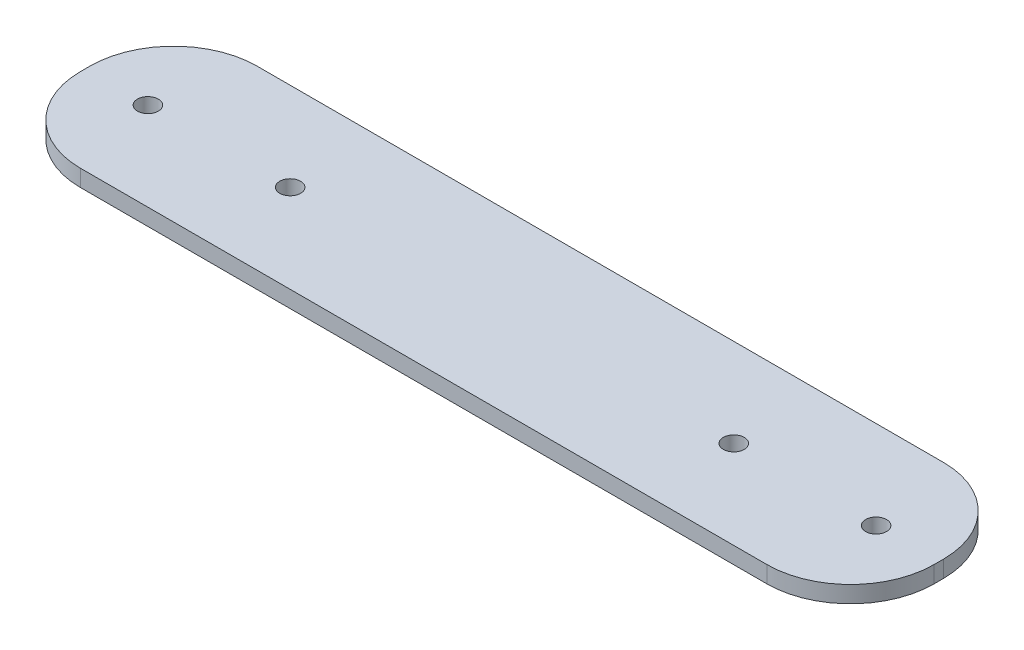
ISO-10303-21;
HEADER;
FILE_DESCRIPTION(('STEP AP214'),'2;1');
FILE_NAME('part.step','',(''),(''),'','','');
FILE_SCHEMA(('AUTOMOTIVE_DESIGN { 1 0 10303 214 1 1 1 1 }'));
ENDSEC;
DATA;
#1=APPLICATION_CONTEXT('core data for automotive mechanical design processes');
#2=APPLICATION_PROTOCOL_DEFINITION('international standard','automotive_design',2000,#1);
#3=PRODUCT_CONTEXT('',#1,'mechanical');
#4=PRODUCT('Part','Part','',(#3));
#5=PRODUCT_RELATED_PRODUCT_CATEGORY('part','',(#4));
#6=PRODUCT_DEFINITION_FORMATION('','',#4);
#7=PRODUCT_DEFINITION_CONTEXT('part definition',#1,'design');
#8=PRODUCT_DEFINITION('design','',#6,#7);
#9=PRODUCT_DEFINITION_SHAPE('','',#8);
#10=(LENGTH_UNIT() NAMED_UNIT(*) SI_UNIT(.MILLI.,.METRE.));
#11=(NAMED_UNIT(*) PLANE_ANGLE_UNIT() SI_UNIT($,.RADIAN.));
#12=(NAMED_UNIT(*) SI_UNIT($,.STERADIAN.) SOLID_ANGLE_UNIT());
#13=UNCERTAINTY_MEASURE_WITH_UNIT(LENGTH_MEASURE(1.E-05),#10,'distance_accuracy_value','');
#14=(GEOMETRIC_REPRESENTATION_CONTEXT(3) GLOBAL_UNCERTAINTY_ASSIGNED_CONTEXT((#13)) GLOBAL_UNIT_ASSIGNED_CONTEXT((#10,
#11,#12)) REPRESENTATION_CONTEXT('',''));
#15=CARTESIAN_POINT('',(0.,0.,0.));
#16=DIRECTION('',(0.,0.,1.));
#17=DIRECTION('',(1.,0.,0.));
#18=AXIS2_PLACEMENT_3D('',#15,#16,#17);
#19=CARTESIAN_POINT('',(0.,2.,0.));
#20=DIRECTION('',(0.,1.,0.));
#21=DIRECTION('',(0.,0.,1.));
#22=AXIS2_PLACEMENT_3D('',#19,#20,#21);
#23=PLANE('',#22);
#24=CARTESIAN_POINT('',(-26.5000000000001,2.,0.));
#25=DIRECTION('',(0.,1.,0.));
#26=DIRECTION('',(0.,0.,1.));
#27=AXIS2_PLACEMENT_3D('',#24,#25,#26);
#28=CIRCLE('',#27,1.25);
#29=CARTESIAN_POINT('',(-26.5000000000001,2.,1.24999999999993));
#30=VERTEX_POINT('',#29);
#31=EDGE_CURVE('E188',#30,#30,#28,.T.);
#32=ORIENTED_EDGE('',*,*,#31,.F.);
#33=EDGE_LOOP('',(#32));
#34=FACE_BOUND('',#33,.T.);
#35=CARTESIAN_POINT('',(43.5,2.,0.));
#36=DIRECTION('',(0.,1.,0.));
#37=DIRECTION('',(0.,0.,1.));
#38=AXIS2_PLACEMENT_3D('',#35,#36,#37);
#39=CIRCLE('',#38,1.24999999999999);
#40=CARTESIAN_POINT('',(43.5,2.,1.24999999999989));
#41=VERTEX_POINT('',#40);
#42=EDGE_CURVE('E172',#41,#41,#39,.T.);
#43=ORIENTED_EDGE('',*,*,#42,.F.);
#44=EDGE_LOOP('',(#43));
#45=FACE_BOUND('',#44,.T.);
#46=DIRECTION('',(0.,0.,-1.));
#47=VECTOR('',#46,1.);
#48=CARTESIAN_POINT('',(51.,2.,-10.5583756345178));
#49=LINE('',#48,#47);
#50=CARTESIAN_POINT('',(51.,2.,0.558375634517773));
#51=VERTEX_POINT('',#50);
#52=CARTESIAN_POINT('',(51.,2.,-0.558375634517773));
#53=VERTEX_POINT('',#52);
#54=EDGE_CURVE('E179',#51,#53,#49,.T.);
#55=ORIENTED_EDGE('',*,*,#54,.T.);
#56=CARTESIAN_POINT('',(41.,2.,-0.558375634517773));
#57=DIRECTION('',(0.,1.,0.));
#58=DIRECTION('',(0.,0.,1.));
#59=AXIS2_PLACEMENT_3D('',#56,#57,#58);
#60=CIRCLE('',#59,10.);
#61=CARTESIAN_POINT('',(41.,2.,-10.5583756345178));
#62=VERTEX_POINT('',#61);
#63=EDGE_CURVE('E156',#53,#62,#60,.T.);
#64=ORIENTED_EDGE('',*,*,#63,.T.);
#65=DIRECTION('',(-1.,0.,0.));
#66=VECTOR('',#65,1.);
#67=CARTESIAN_POINT('',(-51.,2.,-10.5583756345178));
#68=LINE('',#67,#66);
#69=CARTESIAN_POINT('',(-41.,2.,-10.5583756345178));
#70=VERTEX_POINT('',#69);
#71=EDGE_CURVE('E106',#62,#70,#68,.T.);
#72=ORIENTED_EDGE('',*,*,#71,.T.);
#73=CARTESIAN_POINT('',(-41.,2.,-0.558375634517773));
#74=DIRECTION('',(0.,1.,0.));
#75=DIRECTION('',(0.,0.,1.));
#76=AXIS2_PLACEMENT_3D('',#73,#74,#75);
#77=CIRCLE('',#76,10.);
#78=CARTESIAN_POINT('',(-51.,2.,-0.558375634517773));
#79=VERTEX_POINT('',#78);
#80=EDGE_CURVE('E150',#70,#79,#77,.T.);
#81=ORIENTED_EDGE('',*,*,#80,.T.);
#82=DIRECTION('',(0.,0.,1.));
#83=VECTOR('',#82,1.);
#84=CARTESIAN_POINT('',(-51.,2.,-10.5583756345178));
#85=LINE('',#84,#83);
#86=CARTESIAN_POINT('',(-51.,2.,0.558375634517773));
#87=VERTEX_POINT('',#86);
#88=EDGE_CURVE('E129',#79,#87,#85,.T.);
#89=ORIENTED_EDGE('',*,*,#88,.T.);
#90=CARTESIAN_POINT('',(-41.,2.,0.558375634517773));
#91=DIRECTION('',(0.,1.,0.));
#92=DIRECTION('',(0.,0.,1.));
#93=AXIS2_PLACEMENT_3D('',#90,#91,#92);
#94=CIRCLE('',#93,10.);
#95=CARTESIAN_POINT('',(-41.,2.,10.5583756345178));
#96=VERTEX_POINT('',#95);
#97=EDGE_CURVE('E147',#87,#96,#94,.T.);
#98=ORIENTED_EDGE('',*,*,#97,.T.);
#99=DIRECTION('',(1.,0.,0.));
#100=VECTOR('',#99,1.);
#101=CARTESIAN_POINT('',(-51.,2.,10.5583756345178));
#102=LINE('',#101,#100);
#103=CARTESIAN_POINT('',(41.,2.,10.5583756345178));
#104=VERTEX_POINT('',#103);
#105=EDGE_CURVE('E133',#96,#104,#102,.T.);
#106=ORIENTED_EDGE('',*,*,#105,.T.);
#107=CARTESIAN_POINT('',(41.,2.,0.558375634517773));
#108=DIRECTION('',(0.,1.,0.));
#109=DIRECTION('',(0.,0.,1.));
#110=AXIS2_PLACEMENT_3D('',#107,#108,#109);
#111=CIRCLE('',#110,10.);
#112=EDGE_CURVE('E153',#104,#51,#111,.T.);
#113=ORIENTED_EDGE('',*,*,#112,.T.);
#114=EDGE_LOOP('',(#55,#64,#72,#81,#89,#98,#106,#113));
#115=FACE_BOUND('',#114,.T.);
#116=CARTESIAN_POINT('',(26.5,2.,0.));
#117=DIRECTION('',(0.,1.,0.));
#118=DIRECTION('',(0.,0.,1.));
#119=AXIS2_PLACEMENT_3D('',#116,#117,#118);
#120=CIRCLE('',#119,1.24999999999999);
#121=CARTESIAN_POINT('',(26.5,2.,1.2499999999999));
#122=VERTEX_POINT('',#121);
#123=EDGE_CURVE('E183',#122,#122,#120,.T.);
#124=ORIENTED_EDGE('',*,*,#123,.F.);
#125=EDGE_LOOP('',(#124));
#126=FACE_BOUND('',#125,.T.);
#127=CARTESIAN_POINT('',(-43.5000000000001,2.,0.));
#128=DIRECTION('',(0.,1.,0.));
#129=DIRECTION('',(0.,0.,1.));
#130=AXIS2_PLACEMENT_3D('',#127,#128,#129);
#131=CIRCLE('',#130,1.25);
#132=CARTESIAN_POINT('',(-43.5000000000001,2.,1.24999999999993));
#133=VERTEX_POINT('',#132);
#134=EDGE_CURVE('E194',#133,#133,#131,.T.);
#135=ORIENTED_EDGE('',*,*,#134,.F.);
#136=EDGE_LOOP('',(#135));
#137=FACE_BOUND('',#136,.T.);
#138=ADVANCED_FACE('F35',(#34,#45,#115,#126,#137),#23,.T.);
#139=CARTESIAN_POINT('',(0.,0.,0.));
#140=DIRECTION('',(0.,1.,0.));
#141=DIRECTION('',(0.,0.,1.));
#142=AXIS2_PLACEMENT_3D('',#139,#140,#141);
#143=PLANE('',#142);
#144=DIRECTION('',(-1.,0.,0.));
#145=VECTOR('',#144,1.);
#146=CARTESIAN_POINT('',(-51.,0.,-10.5583756345178));
#147=LINE('',#146,#145);
#148=CARTESIAN_POINT('',(41.,0.,-10.5583756345178));
#149=VERTEX_POINT('',#148);
#150=CARTESIAN_POINT('',(-41.,0.,-10.5583756345178));
#151=VERTEX_POINT('',#150);
#152=EDGE_CURVE('E104',#149,#151,#147,.T.);
#153=ORIENTED_EDGE('',*,*,#152,.F.);
#154=CARTESIAN_POINT('',(41.,0.,-0.558375634517773));
#155=DIRECTION('',(0.,1.,0.));
#156=DIRECTION('',(0.,0.,1.));
#157=AXIS2_PLACEMENT_3D('',#154,#155,#156);
#158=CIRCLE('',#157,10.);
#159=CARTESIAN_POINT('',(51.,0.,-0.558375634517773));
#160=VERTEX_POINT('',#159);
#161=EDGE_CURVE('E114',#149,#160,#158,.F.);
#162=ORIENTED_EDGE('',*,*,#161,.T.);
#163=DIRECTION('',(0.,0.,-1.));
#164=VECTOR('',#163,1.);
#165=CARTESIAN_POINT('',(51.,0.,-10.5583756345178));
#166=LINE('',#165,#164);
#167=CARTESIAN_POINT('',(51.,0.,0.558375634517773));
#168=VERTEX_POINT('',#167);
#169=EDGE_CURVE('E130',#168,#160,#166,.T.);
#170=ORIENTED_EDGE('',*,*,#169,.F.);
#171=CARTESIAN_POINT('',(41.,0.,0.558375634517773));
#172=DIRECTION('',(0.,1.,0.));
#173=DIRECTION('',(0.,0.,1.));
#174=AXIS2_PLACEMENT_3D('',#171,#172,#173);
#175=CIRCLE('',#174,10.);
#176=CARTESIAN_POINT('',(41.,0.,10.5583756345178));
#177=VERTEX_POINT('',#176);
#178=EDGE_CURVE('E121',#168,#177,#175,.F.);
#179=ORIENTED_EDGE('',*,*,#178,.T.);
#180=DIRECTION('',(1.,0.,0.));
#181=VECTOR('',#180,1.);
#182=CARTESIAN_POINT('',(-51.,0.,10.5583756345178));
#183=LINE('',#182,#181);
#184=CARTESIAN_POINT('',(-41.,0.,10.5583756345178));
#185=VERTEX_POINT('',#184);
#186=EDGE_CURVE('E135',#185,#177,#183,.T.);
#187=ORIENTED_EDGE('',*,*,#186,.F.);
#188=CARTESIAN_POINT('',(-41.,0.,0.558375634517773));
#189=DIRECTION('',(0.,1.,0.));
#190=DIRECTION('',(0.,0.,1.));
#191=AXIS2_PLACEMENT_3D('',#188,#189,#190);
#192=CIRCLE('',#191,10.);
#193=CARTESIAN_POINT('',(-51.,0.,0.558375634517773));
#194=VERTEX_POINT('',#193);
#195=EDGE_CURVE('E110',#185,#194,#192,.F.);
#196=ORIENTED_EDGE('',*,*,#195,.T.);
#197=DIRECTION('',(0.,0.,1.));
#198=VECTOR('',#197,1.);
#199=CARTESIAN_POINT('',(-51.,0.,-10.5583756345178));
#200=LINE('',#199,#198);
#201=CARTESIAN_POINT('',(-51.,0.,-0.558375634517773));
#202=VERTEX_POINT('',#201);
#203=EDGE_CURVE('E163',#202,#194,#200,.T.);
#204=ORIENTED_EDGE('',*,*,#203,.F.);
#205=CARTESIAN_POINT('',(-41.,0.,-0.558375634517773));
#206=DIRECTION('',(0.,1.,0.));
#207=DIRECTION('',(0.,0.,1.));
#208=AXIS2_PLACEMENT_3D('',#205,#206,#207);
#209=CIRCLE('',#208,10.);
#210=EDGE_CURVE('E128',#202,#151,#209,.F.);
#211=ORIENTED_EDGE('',*,*,#210,.T.);
#212=EDGE_LOOP('',(#153,#162,#170,#179,#187,#196,#204,#211));
#213=FACE_BOUND('',#212,.T.);
#214=CARTESIAN_POINT('',(43.5,0.,0.));
#215=DIRECTION('',(0.,1.,0.));
#216=DIRECTION('',(0.,0.,1.));
#217=AXIS2_PLACEMENT_3D('',#214,#215,#216);
#218=CIRCLE('',#217,1.24999999999999);
#219=CARTESIAN_POINT('',(43.5,0.,1.24999999999989));
#220=VERTEX_POINT('',#219);
#221=EDGE_CURVE('E175',#220,#220,#218,.T.);
#222=ORIENTED_EDGE('',*,*,#221,.T.);
#223=EDGE_LOOP('',(#222));
#224=FACE_BOUND('',#223,.T.);
#225=CARTESIAN_POINT('',(26.5,0.,0.));
#226=DIRECTION('',(0.,1.,0.));
#227=DIRECTION('',(0.,0.,1.));
#228=AXIS2_PLACEMENT_3D('',#225,#226,#227);
#229=CIRCLE('',#228,1.24999999999999);
#230=CARTESIAN_POINT('',(26.5,0.,1.2499999999999));
#231=VERTEX_POINT('',#230);
#232=EDGE_CURVE('E185',#231,#231,#229,.T.);
#233=ORIENTED_EDGE('',*,*,#232,.T.);
#234=EDGE_LOOP('',(#233));
#235=FACE_BOUND('',#234,.T.);
#236=CARTESIAN_POINT('',(-26.5000000000001,0.,0.));
#237=DIRECTION('',(0.,1.,0.));
#238=DIRECTION('',(0.,0.,1.));
#239=AXIS2_PLACEMENT_3D('',#236,#237,#238);
#240=CIRCLE('',#239,1.25);
#241=CARTESIAN_POINT('',(-26.5000000000001,0.,1.24999999999993));
#242=VERTEX_POINT('',#241);
#243=EDGE_CURVE('E191',#242,#242,#240,.T.);
#244=ORIENTED_EDGE('',*,*,#243,.T.);
#245=EDGE_LOOP('',(#244));
#246=FACE_BOUND('',#245,.T.);
#247=CARTESIAN_POINT('',(-43.5000000000001,0.,0.));
#248=DIRECTION('',(0.,1.,0.));
#249=DIRECTION('',(0.,0.,1.));
#250=AXIS2_PLACEMENT_3D('',#247,#248,#249);
#251=CIRCLE('',#250,1.25);
#252=CARTESIAN_POINT('',(-43.5000000000001,0.,1.24999999999993));
#253=VERTEX_POINT('',#252);
#254=EDGE_CURVE('E197',#253,#253,#251,.T.);
#255=ORIENTED_EDGE('',*,*,#254,.T.);
#256=EDGE_LOOP('',(#255));
#257=FACE_BOUND('',#256,.T.);
#258=ADVANCED_FACE('F124',(#213,#224,#235,#246,#257),#143,.F.);
#259=CARTESIAN_POINT('',(-51.,2.,-10.5583756345178));
#260=DIRECTION('',(1.,0.,0.));
#261=DIRECTION('',(0.,0.,-1.));
#262=AXIS2_PLACEMENT_3D('',#259,#260,#261);
#263=PLANE('',#262);
#264=ORIENTED_EDGE('',*,*,#88,.F.);
#265=DIRECTION('',(0.,-1.,0.));
#266=VECTOR('',#265,1.);
#267=CARTESIAN_POINT('',(-51.,2.,-0.558375634517773));
#268=LINE('',#267,#266);
#269=EDGE_CURVE('E11',#79,#202,#268,.T.);
#270=ORIENTED_EDGE('',*,*,#269,.T.);
#271=ORIENTED_EDGE('',*,*,#203,.T.);
#272=DIRECTION('',(0.,-1.,0.));
#273=VECTOR('',#272,1.);
#274=CARTESIAN_POINT('',(-51.,2.,0.558375634517773));
#275=LINE('',#274,#273);
#276=EDGE_CURVE('E43',#194,#87,#275,.F.);
#277=ORIENTED_EDGE('',*,*,#276,.T.);
#278=EDGE_LOOP('',(#264,#270,#271,#277));
#279=FACE_BOUND('',#278,.T.);
#280=ADVANCED_FACE('F162',(#279),#263,.F.);
#281=CARTESIAN_POINT('',(-51.,2.,10.5583756345178));
#282=DIRECTION('',(0.,0.,-1.));
#283=DIRECTION('',(-1.,0.,0.));
#284=AXIS2_PLACEMENT_3D('',#281,#282,#283);
#285=PLANE('',#284);
#286=ORIENTED_EDGE('',*,*,#186,.T.);
#287=DIRECTION('',(0.,-1.,0.));
#288=VECTOR('',#287,1.);
#289=CARTESIAN_POINT('',(41.,2.,10.5583756345178));
#290=LINE('',#289,#288);
#291=EDGE_CURVE('E50',#177,#104,#290,.F.);
#292=ORIENTED_EDGE('',*,*,#291,.T.);
#293=ORIENTED_EDGE('',*,*,#105,.F.);
#294=DIRECTION('',(0.,-1.,0.));
#295=VECTOR('',#294,1.);
#296=CARTESIAN_POINT('',(-41.,2.,10.5583756345178));
#297=LINE('',#296,#295);
#298=EDGE_CURVE('E58',#96,#185,#297,.T.);
#299=ORIENTED_EDGE('',*,*,#298,.T.);
#300=EDGE_LOOP('',(#286,#292,#293,#299));
#301=FACE_BOUND('',#300,.T.);
#302=ADVANCED_FACE('F224',(#301),#285,.F.);
#303=CARTESIAN_POINT('',(51.,2.,-10.5583756345178));
#304=DIRECTION('',(-1.,0.,0.));
#305=DIRECTION('',(0.,0.,1.));
#306=AXIS2_PLACEMENT_3D('',#303,#304,#305);
#307=PLANE('',#306);
#308=ORIENTED_EDGE('',*,*,#169,.T.);
#309=DIRECTION('',(0.,-1.,0.));
#310=VECTOR('',#309,1.);
#311=CARTESIAN_POINT('',(51.,2.,-0.558375634517773));
#312=LINE('',#311,#310);
#313=EDGE_CURVE('E116',#160,#53,#312,.F.);
#314=ORIENTED_EDGE('',*,*,#313,.T.);
#315=ORIENTED_EDGE('',*,*,#54,.F.);
#316=DIRECTION('',(0.,-1.,0.));
#317=VECTOR('',#316,1.);
#318=CARTESIAN_POINT('',(51.,2.,0.558375634517773));
#319=LINE('',#318,#317);
#320=EDGE_CURVE('E120',#51,#168,#319,.T.);
#321=ORIENTED_EDGE('',*,*,#320,.T.);
#322=EDGE_LOOP('',(#308,#314,#315,#321));
#323=FACE_BOUND('',#322,.T.);
#324=ADVANCED_FACE('F221',(#323),#307,.F.);
#325=CARTESIAN_POINT('',(-51.,2.,-10.5583756345178));
#326=DIRECTION('',(0.,0.,1.));
#327=DIRECTION('',(1.,0.,0.));
#328=AXIS2_PLACEMENT_3D('',#325,#326,#327);
#329=PLANE('',#328);
#330=ORIENTED_EDGE('',*,*,#71,.F.);
#331=DIRECTION('',(0.,-1.,0.));
#332=VECTOR('',#331,1.);
#333=CARTESIAN_POINT('',(41.,2.,-10.5583756345178));
#334=LINE('',#333,#332);
#335=EDGE_CURVE('E100',#62,#149,#334,.T.);
#336=ORIENTED_EDGE('',*,*,#335,.T.);
#337=ORIENTED_EDGE('',*,*,#152,.T.);
#338=DIRECTION('',(0.,-1.,0.));
#339=VECTOR('',#338,1.);
#340=CARTESIAN_POINT('',(-41.,2.,-10.5583756345178));
#341=LINE('',#340,#339);
#342=EDGE_CURVE('E111',#151,#70,#341,.F.);
#343=ORIENTED_EDGE('',*,*,#342,.T.);
#344=EDGE_LOOP('',(#330,#336,#337,#343));
#345=FACE_BOUND('',#344,.T.);
#346=ADVANCED_FACE('F102',(#345),#329,.F.);
#347=CARTESIAN_POINT('',(43.5,2.,0.));
#348=DIRECTION('',(0.,-1.,0.));
#349=DIRECTION('',(0.,0.,-1.));
#350=AXIS2_PLACEMENT_3D('',#347,#348,#349);
#351=CYLINDRICAL_SURFACE('',#350,1.24999999999999);
#352=ORIENTED_EDGE('',*,*,#42,.T.);
#353=EDGE_LOOP('',(#352));
#354=FACE_BOUND('',#353,.T.);
#355=ORIENTED_EDGE('',*,*,#221,.F.);
#356=EDGE_LOOP('',(#355));
#357=FACE_BOUND('',#356,.T.);
#358=ADVANCED_FACE('F216',(#354,#357),#351,.F.);
#359=CARTESIAN_POINT('',(26.5,2.,0.));
#360=DIRECTION('',(0.,-1.,0.));
#361=DIRECTION('',(0.,0.,-1.));
#362=AXIS2_PLACEMENT_3D('',#359,#360,#361);
#363=CYLINDRICAL_SURFACE('',#362,1.24999999999999);
#364=ORIENTED_EDGE('',*,*,#123,.T.);
#365=EDGE_LOOP('',(#364));
#366=FACE_BOUND('',#365,.T.);
#367=ORIENTED_EDGE('',*,*,#232,.F.);
#368=EDGE_LOOP('',(#367));
#369=FACE_BOUND('',#368,.T.);
#370=ADVANCED_FACE('F275',(#366,#369),#363,.F.);
#371=CARTESIAN_POINT('',(-26.5000000000001,2.,0.));
#372=DIRECTION('',(0.,-1.,0.));
#373=DIRECTION('',(0.,0.,-1.));
#374=AXIS2_PLACEMENT_3D('',#371,#372,#373);
#375=CYLINDRICAL_SURFACE('',#374,1.25);
#376=ORIENTED_EDGE('',*,*,#31,.T.);
#377=EDGE_LOOP('',(#376));
#378=FACE_BOUND('',#377,.T.);
#379=ORIENTED_EDGE('',*,*,#243,.F.);
#380=EDGE_LOOP('',(#379));
#381=FACE_BOUND('',#380,.T.);
#382=ADVANCED_FACE('F266',(#378,#381),#375,.F.);
#383=CARTESIAN_POINT('',(-43.5000000000001,2.,0.));
#384=DIRECTION('',(0.,-1.,0.));
#385=DIRECTION('',(0.,0.,-1.));
#386=AXIS2_PLACEMENT_3D('',#383,#384,#385);
#387=CYLINDRICAL_SURFACE('',#386,1.25);
#388=ORIENTED_EDGE('',*,*,#134,.T.);
#389=EDGE_LOOP('',(#388));
#390=FACE_BOUND('',#389,.T.);
#391=ORIENTED_EDGE('',*,*,#254,.F.);
#392=EDGE_LOOP('',(#391));
#393=FACE_BOUND('',#392,.T.);
#394=ADVANCED_FACE('F203',(#390,#393),#387,.F.);
#395=CARTESIAN_POINT('',(41.,2.,-0.558375634517773));
#396=DIRECTION('',(0.,-1.,0.));
#397=DIRECTION('',(0.,0.,-1.));
#398=AXIS2_PLACEMENT_3D('',#395,#396,#397);
#399=CYLINDRICAL_SURFACE('',#398,10.);
#400=ORIENTED_EDGE('',*,*,#63,.F.);
#401=ORIENTED_EDGE('',*,*,#313,.F.);
#402=ORIENTED_EDGE('',*,*,#161,.F.);
#403=ORIENTED_EDGE('',*,*,#335,.F.);
#404=EDGE_LOOP('',(#400,#401,#402,#403));
#405=FACE_BOUND('',#404,.T.);
#406=ADVANCED_FACE('F115',(#405),#399,.T.);
#407=CARTESIAN_POINT('',(41.,2.,0.558375634517773));
#408=DIRECTION('',(0.,-1.,0.));
#409=DIRECTION('',(0.,0.,-1.));
#410=AXIS2_PLACEMENT_3D('',#407,#408,#409);
#411=CYLINDRICAL_SURFACE('',#410,10.);
#412=ORIENTED_EDGE('',*,*,#112,.F.);
#413=ORIENTED_EDGE('',*,*,#291,.F.);
#414=ORIENTED_EDGE('',*,*,#178,.F.);
#415=ORIENTED_EDGE('',*,*,#320,.F.);
#416=EDGE_LOOP('',(#412,#413,#414,#415));
#417=FACE_BOUND('',#416,.T.);
#418=ADVANCED_FACE('F232',(#417),#411,.T.);
#419=CARTESIAN_POINT('',(-41.,2.,-0.558375634517773));
#420=DIRECTION('',(0.,-1.,0.));
#421=DIRECTION('',(0.,0.,-1.));
#422=AXIS2_PLACEMENT_3D('',#419,#420,#421);
#423=CYLINDRICAL_SURFACE('',#422,10.);
#424=ORIENTED_EDGE('',*,*,#80,.F.);
#425=ORIENTED_EDGE('',*,*,#342,.F.);
#426=ORIENTED_EDGE('',*,*,#210,.F.);
#427=ORIENTED_EDGE('',*,*,#269,.F.);
#428=EDGE_LOOP('',(#424,#425,#426,#427));
#429=FACE_BOUND('',#428,.T.);
#430=ADVANCED_FACE('F170',(#429),#423,.T.);
#431=CARTESIAN_POINT('',(-41.,2.,0.558375634517773));
#432=DIRECTION('',(0.,-1.,0.));
#433=DIRECTION('',(0.,0.,-1.));
#434=AXIS2_PLACEMENT_3D('',#431,#432,#433);
#435=CYLINDRICAL_SURFACE('',#434,10.);
#436=ORIENTED_EDGE('',*,*,#97,.F.);
#437=ORIENTED_EDGE('',*,*,#276,.F.);
#438=ORIENTED_EDGE('',*,*,#195,.F.);
#439=ORIENTED_EDGE('',*,*,#298,.F.);
#440=EDGE_LOOP('',(#436,#437,#438,#439));
#441=FACE_BOUND('',#440,.T.);
#442=ADVANCED_FACE('F37',(#441),#435,.T.);
#443=CLOSED_SHELL('',(#138,#258,#280,#302,#324,#346,#358,#370,#382,#394,#406,#418,#430,#442));
#444=MANIFOLD_SOLID_BREP('B2',#443);
#445=ADVANCED_BREP_SHAPE_REPRESENTATION('',(#18,#444),#14);
#446=SHAPE_DEFINITION_REPRESENTATION(#9,#445);
ENDSEC;
END-ISO-10303-21;
